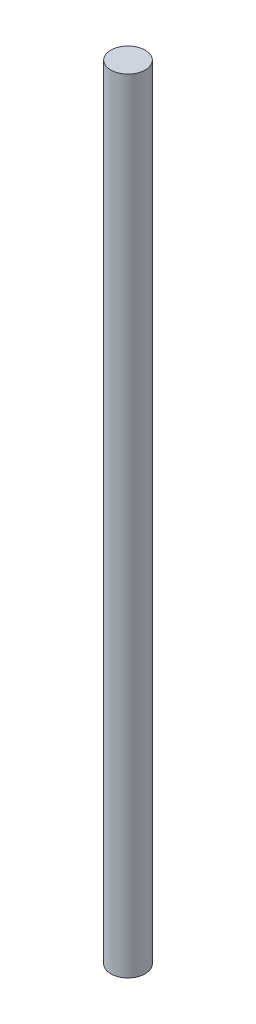
ISO-10303-21;
HEADER;
FILE_DESCRIPTION(('STEP AP214'),'2;1');
FILE_NAME('part.step','',(''),(''),'','','');
FILE_SCHEMA(('AUTOMOTIVE_DESIGN { 1 0 10303 214 1 1 1 1 }'));
ENDSEC;
DATA;
#1=APPLICATION_CONTEXT('core data for automotive mechanical design processes');
#2=APPLICATION_PROTOCOL_DEFINITION('international standard','automotive_design',2000,#1);
#3=PRODUCT_CONTEXT('',#1,'mechanical');
#4=PRODUCT('Part','Part','',(#3));
#5=PRODUCT_RELATED_PRODUCT_CATEGORY('part','',(#4));
#6=PRODUCT_DEFINITION_FORMATION('','',#4);
#7=PRODUCT_DEFINITION_CONTEXT('part definition',#1,'design');
#8=PRODUCT_DEFINITION('design','',#6,#7);
#9=PRODUCT_DEFINITION_SHAPE('','',#8);
#10=(LENGTH_UNIT() NAMED_UNIT(*) SI_UNIT(.MILLI.,.METRE.));
#11=(NAMED_UNIT(*) PLANE_ANGLE_UNIT() SI_UNIT($,.RADIAN.));
#12=(NAMED_UNIT(*) SI_UNIT($,.STERADIAN.) SOLID_ANGLE_UNIT());
#13=UNCERTAINTY_MEASURE_WITH_UNIT(LENGTH_MEASURE(1.E-05),#10,'distance_accuracy_value','');
#14=(GEOMETRIC_REPRESENTATION_CONTEXT(3) GLOBAL_UNCERTAINTY_ASSIGNED_CONTEXT((#13)) GLOBAL_UNIT_ASSIGNED_CONTEXT((#10,
#11,#12)) REPRESENTATION_CONTEXT('',''));
#15=CARTESIAN_POINT('',(0.,0.,0.));
#16=DIRECTION('',(0.,0.,1.));
#17=DIRECTION('',(1.,0.,0.));
#18=AXIS2_PLACEMENT_3D('',#15,#16,#17);
#19=CARTESIAN_POINT('',(0.,83.693,0.));
#20=DIRECTION('',(0.,-1.,0.));
#21=DIRECTION('',(0.,0.,-1.));
#22=AXIS2_PLACEMENT_3D('',#19,#20,#21);
#23=CYLINDRICAL_SURFACE('',#22,1.8415);
#24=CARTESIAN_POINT('',(0.,83.693,0.));
#25=DIRECTION('',(0.,1.,0.));
#26=DIRECTION('',(0.,0.,1.));
#27=AXIS2_PLACEMENT_3D('',#24,#25,#26);
#28=CIRCLE('',#27,1.8415);
#29=CARTESIAN_POINT('',(0.,83.693,1.8415));
#30=VERTEX_POINT('',#29);
#31=EDGE_CURVE('E10',#30,#30,#28,.T.);
#32=ORIENTED_EDGE('',*,*,#31,.F.);
#33=EDGE_LOOP('',(#32));
#34=FACE_BOUND('',#33,.T.);
#35=CARTESIAN_POINT('',(0.,0.,0.));
#36=DIRECTION('',(0.,1.,0.));
#37=DIRECTION('',(0.,0.,1.));
#38=AXIS2_PLACEMENT_3D('',#35,#36,#37);
#39=CIRCLE('',#38,1.8415);
#40=CARTESIAN_POINT('',(0.,0.,1.8415));
#41=VERTEX_POINT('',#40);
#42=EDGE_CURVE('E36',#41,#41,#39,.T.);
#43=ORIENTED_EDGE('',*,*,#42,.T.);
#44=EDGE_LOOP('',(#43));
#45=FACE_BOUND('',#44,.T.);
#46=ADVANCED_FACE('F33',(#34,#45),#23,.T.);
#47=CARTESIAN_POINT('',(0.,83.693,0.));
#48=DIRECTION('',(0.,1.,0.));
#49=DIRECTION('',(0.,0.,1.));
#50=AXIS2_PLACEMENT_3D('',#47,#48,#49);
#51=PLANE('',#50);
#52=ORIENTED_EDGE('',*,*,#31,.T.);
#53=EDGE_LOOP('',(#52));
#54=FACE_BOUND('',#53,.T.);
#55=ADVANCED_FACE('F48',(#54),#51,.T.);
#56=CARTESIAN_POINT('',(0.,0.,0.));
#57=DIRECTION('',(0.,1.,0.));
#58=DIRECTION('',(0.,0.,1.));
#59=AXIS2_PLACEMENT_3D('',#56,#57,#58);
#60=PLANE('',#59);
#61=ORIENTED_EDGE('',*,*,#42,.F.);
#62=EDGE_LOOP('',(#61));
#63=FACE_BOUND('',#62,.T.);
#64=ADVANCED_FACE('F46',(#63),#60,.F.);
#65=CLOSED_SHELL('',(#46,#55,#64));
#66=MANIFOLD_SOLID_BREP('B2',#65);
#67=ADVANCED_BREP_SHAPE_REPRESENTATION('',(#18,#66),#14);
#68=SHAPE_DEFINITION_REPRESENTATION(#9,#67);
ENDSEC;
END-ISO-10303-21;
